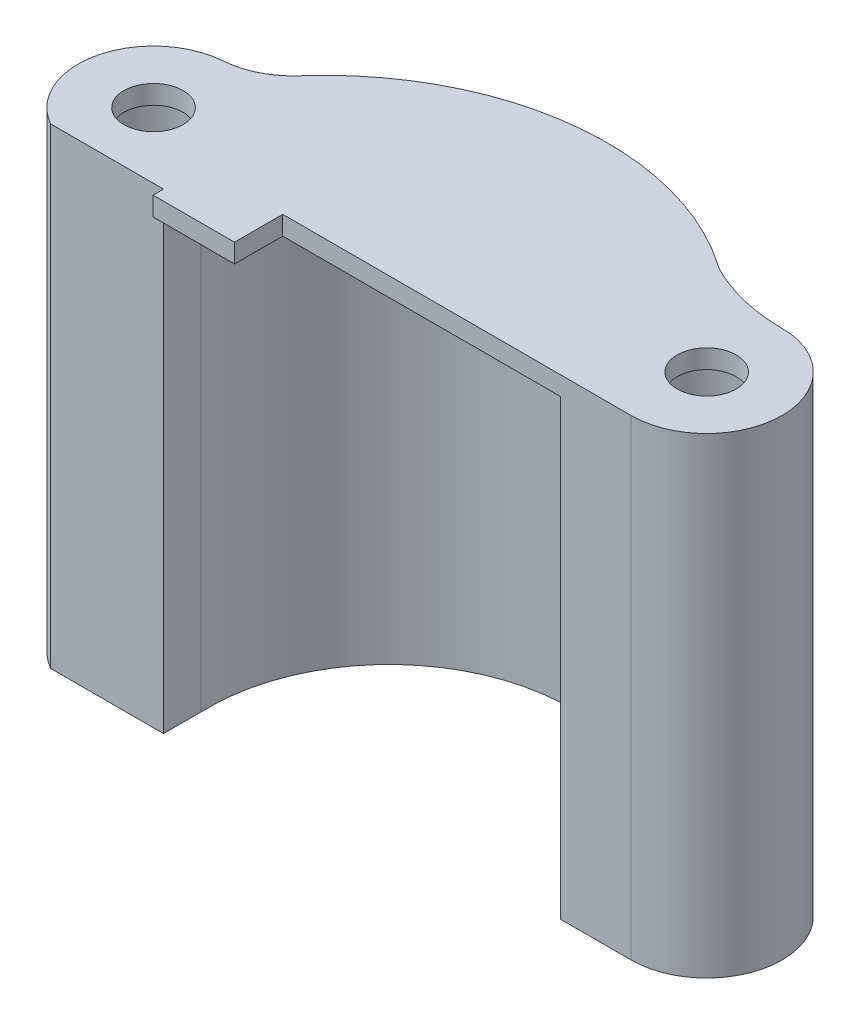
ISO-10303-21;
HEADER;
FILE_DESCRIPTION(('STEP AP214'),'2;1');
FILE_NAME('part.step','',(''),(''),'','','');
FILE_SCHEMA(('AUTOMOTIVE_DESIGN { 1 0 10303 214 1 1 1 1 }'));
ENDSEC;
DATA;
#1=APPLICATION_CONTEXT('core data for automotive mechanical design processes');
#2=APPLICATION_PROTOCOL_DEFINITION('international standard','automotive_design',2000,#1);
#3=PRODUCT_CONTEXT('',#1,'mechanical');
#4=PRODUCT('Part','Part','',(#3));
#5=PRODUCT_RELATED_PRODUCT_CATEGORY('part','',(#4));
#6=PRODUCT_DEFINITION_FORMATION('','',#4);
#7=PRODUCT_DEFINITION_CONTEXT('part definition',#1,'design');
#8=PRODUCT_DEFINITION('design','',#6,#7);
#9=PRODUCT_DEFINITION_SHAPE('','',#8);
#10=(LENGTH_UNIT() NAMED_UNIT(*) SI_UNIT(.MILLI.,.METRE.));
#11=(NAMED_UNIT(*) PLANE_ANGLE_UNIT() SI_UNIT($,.RADIAN.));
#12=(NAMED_UNIT(*) SI_UNIT($,.STERADIAN.) SOLID_ANGLE_UNIT());
#13=UNCERTAINTY_MEASURE_WITH_UNIT(LENGTH_MEASURE(1.E-05),#10,'distance_accuracy_value','');
#14=(GEOMETRIC_REPRESENTATION_CONTEXT(3) GLOBAL_UNCERTAINTY_ASSIGNED_CONTEXT((#13)) GLOBAL_UNIT_ASSIGNED_CONTEXT((#10,
#11,#12)) REPRESENTATION_CONTEXT('',''));
#15=CARTESIAN_POINT('',(0.,0.,0.));
#16=DIRECTION('',(0.,0.,1.));
#17=DIRECTION('',(1.,0.,0.));
#18=AXIS2_PLACEMENT_3D('',#15,#16,#17);
#19=CARTESIAN_POINT('',(-13.6378226737925,38.1,0.));
#20=DIRECTION('',(-1.,0.,0.));
#21=DIRECTION('',(0.,0.,1.));
#22=AXIS2_PLACEMENT_3D('',#19,#20,#21);
#23=PLANE('',#22);
#24=DIRECTION('',(0.,0.,1.));
#25=VECTOR('',#24,1.);
#26=CARTESIAN_POINT('',(-13.6378226737925,38.1,0.));
#27=LINE('',#26,#25);
#28=CARTESIAN_POINT('',(-13.6378226737925,38.1,15.7404965999173));
#29=VERTEX_POINT('',#28);
#30=CARTESIAN_POINT('',(-13.6378226737925,38.1,18.9154965999173));
#31=VERTEX_POINT('',#30);
#32=EDGE_CURVE('E321',#29,#31,#27,.T.);
#33=ORIENTED_EDGE('',*,*,#32,.T.);
#34=DIRECTION('',(0.,-1.,0.));
#35=VECTOR('',#34,1.);
#36=CARTESIAN_POINT('',(-13.6378226737925,38.1,18.9154965999173));
#37=LINE('',#36,#35);
#38=CARTESIAN_POINT('',(-13.6378226737925,0.,18.9154965999173));
#39=VERTEX_POINT('',#38);
#40=EDGE_CURVE('E268',#31,#39,#37,.T.);
#41=ORIENTED_EDGE('',*,*,#40,.T.);
#42=DIRECTION('',(0.,0.,-1.));
#43=VECTOR('',#42,1.);
#44=CARTESIAN_POINT('',(-13.6378226737925,0.,0.));
#45=LINE('',#44,#43);
#46=CARTESIAN_POINT('',(-13.6378226737925,0.,15.7404965999173));
#47=VERTEX_POINT('',#46);
#48=EDGE_CURVE('E225',#39,#47,#45,.T.);
#49=ORIENTED_EDGE('',*,*,#48,.T.);
#50=DIRECTION('',(0.,-1.,0.));
#51=VECTOR('',#50,1.);
#52=CARTESIAN_POINT('',(-13.6378226737925,38.1,15.7404965999173));
#53=LINE('',#52,#51);
#54=EDGE_CURVE('E264',#29,#47,#53,.T.);
#55=ORIENTED_EDGE('',*,*,#54,.F.);
#56=EDGE_LOOP('',(#33,#41,#49,#55));
#57=FACE_BOUND('',#56,.T.);
#58=ADVANCED_FACE('F41',(#57),#23,.F.);
#59=CARTESIAN_POINT('',(0.,38.1,15.7404965999173));
#60=DIRECTION('',(0.,0.,-1.));
#61=DIRECTION('',(-1.,0.,0.));
#62=AXIS2_PLACEMENT_3D('',#59,#60,#61);
#63=PLANE('',#62);
#64=DIRECTION('',(0.,1.,0.));
#65=VECTOR('',#64,1.);
#66=CARTESIAN_POINT('',(-6.77982267379246,17.7380475663924,15.7404965999173));
#67=LINE('',#66,#65);
#68=CARTESIAN_POINT('',(-6.77982267379246,38.1,15.7404965999173));
#69=VERTEX_POINT('',#68);
#70=CARTESIAN_POINT('',(-6.77982267379246,39.6875,15.7404965999173));
#71=VERTEX_POINT('',#70);
#72=EDGE_CURVE('E145',#69,#71,#67,.T.);
#73=ORIENTED_EDGE('',*,*,#72,.F.);
#74=DIRECTION('',(1.,0.,0.));
#75=VECTOR('',#74,1.);
#76=CARTESIAN_POINT('',(-13.6378226737925,38.1,15.7404965999173));
#77=LINE('',#76,#75);
#78=CARTESIAN_POINT('',(16.6090859378619,38.1,15.7404965999173));
#79=VERTEX_POINT('',#78);
#80=EDGE_CURVE('E175',#69,#79,#77,.T.);
#81=ORIENTED_EDGE('',*,*,#80,.T.);
#82=DIRECTION('',(0.,-1.,0.));
#83=VECTOR('',#82,1.);
#84=CARTESIAN_POINT('',(16.6090859378619,38.1,15.7404965999173));
#85=LINE('',#84,#83);
#86=CARTESIAN_POINT('',(16.6090859378619,0.,15.7404965999173));
#87=VERTEX_POINT('',#86);
#88=EDGE_CURVE('E257',#79,#87,#85,.T.);
#89=ORIENTED_EDGE('',*,*,#88,.T.);
#90=DIRECTION('',(1.,0.,0.));
#91=VECTOR('',#90,1.);
#92=CARTESIAN_POINT('',(0.,0.,15.7404965999173));
#93=LINE('',#92,#91);
#94=CARTESIAN_POINT('',(22.5456913931761,0.,15.7404965999173));
#95=VERTEX_POINT('',#94);
#96=EDGE_CURVE('E235',#87,#95,#93,.T.);
#97=ORIENTED_EDGE('',*,*,#96,.T.);
#98=DIRECTION('',(0.,-1.,0.));
#99=VECTOR('',#98,1.);
#100=CARTESIAN_POINT('',(22.5456913931761,38.1,15.7404965999173));
#101=LINE('',#100,#99);
#102=CARTESIAN_POINT('',(22.5456913931761,39.6875,15.7404965999173));
#103=VERTEX_POINT('',#102);
#104=EDGE_CURVE('E171',#103,#95,#101,.T.);
#105=ORIENTED_EDGE('',*,*,#104,.F.);
#106=DIRECTION('',(1.,0.,0.));
#107=VECTOR('',#106,1.);
#108=CARTESIAN_POINT('',(16.6090859378619,39.6875,15.7404965999173));
#109=LINE('',#108,#107);
#110=EDGE_CURVE('E162',#71,#103,#109,.T.);
#111=ORIENTED_EDGE('',*,*,#110,.F.);
#112=EDGE_LOOP('',(#73,#81,#89,#97,#105,#111));
#113=FACE_BOUND('',#112,.T.);
#114=ADVANCED_FACE('F169',(#113),#63,.F.);
#115=CARTESIAN_POINT('',(16.6090859378619,38.1,0.));
#116=DIRECTION('',(1.,0.,0.));
#117=DIRECTION('',(0.,0.,-1.));
#118=AXIS2_PLACEMENT_3D('',#115,#116,#117);
#119=PLANE('',#118);
#120=DIRECTION('',(0.,0.,-1.));
#121=VECTOR('',#120,1.);
#122=CARTESIAN_POINT('',(16.6090859378619,38.1,0.));
#123=LINE('',#122,#121);
#124=CARTESIAN_POINT('',(16.6090859378619,38.1,12.5654965999173));
#125=VERTEX_POINT('',#124);
#126=EDGE_CURVE('E336',#79,#125,#123,.T.);
#127=ORIENTED_EDGE('',*,*,#126,.T.);
#128=DIRECTION('',(0.,-1.,0.));
#129=VECTOR('',#128,1.);
#130=CARTESIAN_POINT('',(16.6090859378619,38.1,12.5654965999173));
#131=LINE('',#130,#129);
#132=CARTESIAN_POINT('',(16.6090859378619,0.,12.5654965999173));
#133=VERTEX_POINT('',#132);
#134=EDGE_CURVE('E260',#125,#133,#131,.T.);
#135=ORIENTED_EDGE('',*,*,#134,.T.);
#136=DIRECTION('',(0.,0.,1.));
#137=VECTOR('',#136,1.);
#138=CARTESIAN_POINT('',(16.6090859378619,0.,0.));
#139=LINE('',#138,#137);
#140=EDGE_CURVE('E231',#133,#87,#139,.T.);
#141=ORIENTED_EDGE('',*,*,#140,.T.);
#142=ORIENTED_EDGE('',*,*,#88,.F.);
#143=EDGE_LOOP('',(#127,#135,#141,#142));
#144=FACE_BOUND('',#143,.T.);
#145=ADVANCED_FACE('F384',(#144),#119,.F.);
#146=CARTESIAN_POINT('',(1.66297527786936,38.1,20.6134230140809));
#147=DIRECTION('',(0.,-1.,0.));
#148=DIRECTION('',(0.,0.,-1.));
#149=AXIS2_PLACEMENT_3D('',#146,#147,#148);
#150=CYLINDRICAL_SURFACE('',#149,23.746023500555);
#151=CARTESIAN_POINT('',(1.66297527786936,39.6875,20.6134230140809));
#152=DIRECTION('',(0.,1.,0.));
#153=DIRECTION('',(0.,0.,1.));
#154=AXIS2_PLACEMENT_3D('',#151,#152,#153);
#155=CIRCLE('',#154,23.746023500555);
#156=CARTESIAN_POINT('',(15.1487765830653,39.6875,1.06842889165444));
#157=VERTEX_POINT('',#156);
#158=CARTESIAN_POINT('',(-16.1639042572107,39.6875,4.92661332789374));
#159=VERTEX_POINT('',#158);
#160=EDGE_CURVE('E190',#157,#159,#155,.T.);
#161=ORIENTED_EDGE('',*,*,#160,.F.);
#162=DIRECTION('',(0.,-1.,0.));
#163=VECTOR('',#162,1.);
#164=CARTESIAN_POINT('',(15.1487765830653,38.1,1.06842889165443));
#165=LINE('',#164,#163);
#166=CARTESIAN_POINT('',(15.1487765830653,0.,1.06842889165443));
#167=VERTEX_POINT('',#166);
#168=EDGE_CURVE('E279',#157,#167,#165,.T.);
#169=ORIENTED_EDGE('',*,*,#168,.T.);
#170=CARTESIAN_POINT('',(1.66297527786936,0.,20.6134230140809));
#171=DIRECTION('',(0.,1.,0.));
#172=DIRECTION('',(0.,0.,1.));
#173=AXIS2_PLACEMENT_3D('',#170,#171,#172);
#174=CIRCLE('',#173,23.746023500555);
#175=CARTESIAN_POINT('',(-16.1639042572107,0.,4.92661332789373));
#176=VERTEX_POINT('',#175);
#177=EDGE_CURVE('E211',#176,#167,#174,.F.);
#178=ORIENTED_EDGE('',*,*,#177,.F.);
#179=DIRECTION('',(0.,-1.,0.));
#180=VECTOR('',#179,1.);
#181=CARTESIAN_POINT('',(-16.1639042572107,38.1,4.92661332789373));
#182=LINE('',#181,#180);
#183=EDGE_CURVE('E276',#176,#159,#182,.F.);
#184=ORIENTED_EDGE('',*,*,#183,.T.);
#185=EDGE_LOOP('',(#161,#169,#178,#184));
#186=FACE_BOUND('',#185,.T.);
#187=ADVANCED_FACE('F303',(#186),#150,.T.);
#188=CARTESIAN_POINT('',(-19.9966884261341,38.1,13.3973356971205));
#189=DIRECTION('',(0.,-1.,0.));
#190=DIRECTION('',(0.,0.,-1.));
#191=AXIS2_PLACEMENT_3D('',#188,#189,#190);
#192=CYLINDRICAL_SURFACE('',#191,6.35);
#193=CARTESIAN_POINT('',(-19.9966884261341,39.6875,13.3973356971205));
#194=DIRECTION('',(0.,1.,0.));
#195=DIRECTION('',(0.,0.,1.));
#196=AXIS2_PLACEMENT_3D('',#193,#194,#195);
#197=CIRCLE('',#196,6.35);
#198=CARTESIAN_POINT('',(-20.4638677435349,39.6875,7.06454456797428));
#199=VERTEX_POINT('',#198);
#200=CARTESIAN_POINT('',(-23.1387260215241,39.6875,18.9154965999173));
#201=VERTEX_POINT('',#200);
#202=EDGE_CURVE('E193',#199,#201,#197,.T.);
#203=ORIENTED_EDGE('',*,*,#202,.F.);
#204=DIRECTION('',(0.,-1.,0.));
#205=VECTOR('',#204,1.);
#206=CARTESIAN_POINT('',(-20.4638677435349,38.1,7.06454456797428));
#207=LINE('',#206,#205);
#208=CARTESIAN_POINT('',(-20.4638677435349,0.,7.06454456797428));
#209=VERTEX_POINT('',#208);
#210=EDGE_CURVE('E286',#199,#209,#207,.T.);
#211=ORIENTED_EDGE('',*,*,#210,.T.);
#212=CARTESIAN_POINT('',(-19.9966884261341,0.,13.3973356971205));
#213=DIRECTION('',(0.,1.,0.));
#214=DIRECTION('',(0.,0.,1.));
#215=AXIS2_PLACEMENT_3D('',#212,#213,#214);
#216=CIRCLE('',#215,6.35);
#217=CARTESIAN_POINT('',(-23.1387260215241,0.,18.9154965999173));
#218=VERTEX_POINT('',#217);
#219=EDGE_CURVE('E218',#209,#218,#216,.T.);
#220=ORIENTED_EDGE('',*,*,#219,.T.);
#221=DIRECTION('',(0.,-1.,0.));
#222=VECTOR('',#221,1.);
#223=CARTESIAN_POINT('',(-23.1387260215241,38.1,18.9154965999173));
#224=LINE('',#223,#222);
#225=EDGE_CURVE('E272',#201,#218,#224,.T.);
#226=ORIENTED_EDGE('',*,*,#225,.F.);
#227=EDGE_LOOP('',(#203,#211,#220,#226));
#228=FACE_BOUND('',#227,.T.);
#229=ADVANCED_FACE('F306',(#228),#192,.T.);
#230=CARTESIAN_POINT('',(0.,38.1,18.9154965999173));
#231=DIRECTION('',(0.,0.,-1.));
#232=DIRECTION('',(-1.,0.,0.));
#233=AXIS2_PLACEMENT_3D('',#230,#231,#232);
#234=PLANE('',#233);
#235=DIRECTION('',(1.,0.,0.));
#236=VECTOR('',#235,1.);
#237=CARTESIAN_POINT('',(0.,0.,18.9154965999173));
#238=LINE('',#237,#236);
#239=EDGE_CURVE('E221',#218,#39,#238,.T.);
#240=ORIENTED_EDGE('',*,*,#239,.T.);
#241=ORIENTED_EDGE('',*,*,#40,.F.);
#242=CARTESIAN_POINT('',(-13.6378226737925,39.6875,18.9154965999173));
#243=VERTEX_POINT('',#242);
#244=EDGE_CURVE('E269',#243,#31,#37,.T.);
#245=ORIENTED_EDGE('',*,*,#244,.F.);
#246=DIRECTION('',(1.,0.,0.));
#247=VECTOR('',#246,1.);
#248=CARTESIAN_POINT('',(-23.1387260215241,39.6875,18.9154965999173));
#249=LINE('',#248,#247);
#250=EDGE_CURVE('E196',#201,#243,#249,.T.);
#251=ORIENTED_EDGE('',*,*,#250,.F.);
#252=ORIENTED_EDGE('',*,*,#225,.T.);
#253=EDGE_LOOP('',(#240,#241,#245,#251,#252));
#254=FACE_BOUND('',#253,.T.);
#255=ADVANCED_FACE('F311',(#254),#234,.F.);
#256=CARTESIAN_POINT('',(1.59099250923585,38.1,15.1567259932861));
#257=DIRECTION('',(0.,-1.,0.));
#258=DIRECTION('',(0.,0.,-1.));
#259=AXIS2_PLACEMENT_3D('',#256,#257,#258);
#260=CYLINDRICAL_SURFACE('',#259,15.24);
#261=CARTESIAN_POINT('',(1.59099250923585,0.,15.1567259932861));
#262=DIRECTION('',(0.,1.,0.));
#263=DIRECTION('',(0.,0.,1.));
#264=AXIS2_PLACEMENT_3D('',#261,#262,#263);
#265=CIRCLE('',#264,15.24);
#266=EDGE_CURVE('E228',#47,#133,#265,.F.);
#267=ORIENTED_EDGE('',*,*,#266,.T.);
#268=ORIENTED_EDGE('',*,*,#134,.F.);
#269=CARTESIAN_POINT('',(1.59099250923585,38.1,15.1567259932861));
#270=DIRECTION('',(0.,1.,0.));
#271=DIRECTION('',(0.,0.,1.));
#272=AXIS2_PLACEMENT_3D('',#269,#270,#271);
#273=CIRCLE('',#272,15.24);
#274=EDGE_CURVE('E201',#29,#125,#273,.F.);
#275=ORIENTED_EDGE('',*,*,#274,.F.);
#276=ORIENTED_EDGE('',*,*,#54,.T.);
#277=EDGE_LOOP('',(#267,#268,#275,#276));
#278=FACE_BOUND('',#277,.T.);
#279=ADVANCED_FACE('F388',(#278),#260,.F.);
#280=CARTESIAN_POINT('',(22.545691393176,38.1,9.39049659991733));
#281=DIRECTION('',(0.,-1.,0.));
#282=DIRECTION('',(0.,0.,-1.));
#283=AXIS2_PLACEMENT_3D('',#280,#281,#282);
#284=CYLINDRICAL_SURFACE('',#283,6.35);
#285=CARTESIAN_POINT('',(22.545691393176,0.,9.39049659991733));
#286=DIRECTION('',(0.,1.,0.));
#287=DIRECTION('',(0.,0.,1.));
#288=AXIS2_PLACEMENT_3D('',#285,#286,#287);
#289=CIRCLE('',#288,6.35);
#290=CARTESIAN_POINT('',(22.545691393176,0.,3.04049659991733));
#291=VERTEX_POINT('',#290);
#292=EDGE_CURVE('E238',#95,#291,#289,.T.);
#293=ORIENTED_EDGE('',*,*,#292,.T.);
#294=DIRECTION('',(0.,-1.,0.));
#295=VECTOR('',#294,1.);
#296=CARTESIAN_POINT('',(22.545691393176,38.1,3.04049659991733));
#297=LINE('',#296,#295);
#298=CARTESIAN_POINT('',(22.545691393176,39.6875,3.04049659991733));
#299=VERTEX_POINT('',#298);
#300=EDGE_CURVE('E205',#299,#291,#297,.T.);
#301=ORIENTED_EDGE('',*,*,#300,.F.);
#302=CARTESIAN_POINT('',(22.545691393176,39.6875,9.39049659991733));
#303=DIRECTION('',(0.,1.,0.));
#304=DIRECTION('',(0.,0.,1.));
#305=AXIS2_PLACEMENT_3D('',#302,#303,#304);
#306=CIRCLE('',#305,6.35);
#307=EDGE_CURVE('E174',#103,#299,#306,.T.);
#308=ORIENTED_EDGE('',*,*,#307,.F.);
#309=ORIENTED_EDGE('',*,*,#104,.T.);
#310=EDGE_LOOP('',(#293,#301,#308,#309));
#311=FACE_BOUND('',#310,.T.);
#312=ADVANCED_FACE('F414',(#311),#284,.T.);
#313=CARTESIAN_POINT('',(22.545691393176,38.1,9.39049659991733));
#314=DIRECTION('',(0.,-1.,0.));
#315=DIRECTION('',(0.,0.,-1.));
#316=AXIS2_PLACEMENT_3D('',#313,#314,#315);
#317=CYLINDRICAL_SURFACE('',#316,4.7625);
#318=CARTESIAN_POINT('',(22.545691393176,38.1,9.39049659991733));
#319=DIRECTION('',(0.,1.,0.));
#320=DIRECTION('',(0.,0.,1.));
#321=AXIS2_PLACEMENT_3D('',#318,#319,#320);
#322=CIRCLE('',#321,4.7625);
#323=CARTESIAN_POINT('',(22.545691393176,38.1,14.1529965999173));
#324=VERTEX_POINT('',#323);
#325=EDGE_CURVE('E207',#324,#324,#322,.T.);
#326=ORIENTED_EDGE('',*,*,#325,.T.);
#327=EDGE_LOOP('',(#326));
#328=FACE_BOUND('',#327,.T.);
#329=CARTESIAN_POINT('',(22.545691393176,0.,9.39049659991733));
#330=DIRECTION('',(0.,1.,0.));
#331=DIRECTION('',(0.,0.,1.));
#332=AXIS2_PLACEMENT_3D('',#329,#330,#331);
#333=CIRCLE('',#332,4.7625);
#334=CARTESIAN_POINT('',(22.545691393176,0.,14.1529965999173));
#335=VERTEX_POINT('',#334);
#336=EDGE_CURVE('E245',#335,#335,#333,.T.);
#337=ORIENTED_EDGE('',*,*,#336,.F.);
#338=EDGE_LOOP('',(#337));
#339=FACE_BOUND('',#338,.T.);
#340=ADVANCED_FACE('F416',(#328,#339),#317,.F.);
#341=CARTESIAN_POINT('',(22.545691393176,38.1,-12.1995034000827));
#342=DIRECTION('',(0.,-1.,0.));
#343=DIRECTION('',(0.,0.,-1.));
#344=AXIS2_PLACEMENT_3D('',#341,#342,#343);
#345=CYLINDRICAL_SURFACE('',#344,15.24);
#346=CARTESIAN_POINT('',(22.545691393176,0.,-12.1995034000827));
#347=DIRECTION('',(0.,1.,0.));
#348=DIRECTION('',(0.,0.,1.));
#349=AXIS2_PLACEMENT_3D('',#346,#347,#348);
#350=CIRCLE('',#349,15.24);
#351=CARTESIAN_POINT('',(16.0474623590527,0.,1.58565599036608));
#352=VERTEX_POINT('',#351);
#353=EDGE_CURVE('E241',#291,#352,#350,.F.);
#354=ORIENTED_EDGE('',*,*,#353,.T.);
#355=DIRECTION('',(0.,-1.,0.));
#356=VECTOR('',#355,1.);
#357=CARTESIAN_POINT('',(16.0474623590527,38.1,1.58565599036608));
#358=LINE('',#357,#356);
#359=CARTESIAN_POINT('',(16.0474623590527,39.6875,1.58565599036608));
#360=VERTEX_POINT('',#359);
#361=EDGE_CURVE('E283',#352,#360,#358,.F.);
#362=ORIENTED_EDGE('',*,*,#361,.T.);
#363=CARTESIAN_POINT('',(22.545691393176,39.6875,-12.1995034000827));
#364=DIRECTION('',(0.,-1.,0.));
#365=DIRECTION('',(0.,0.,1.));
#366=AXIS2_PLACEMENT_3D('',#363,#364,#365);
#367=CIRCLE('',#366,15.24);
#368=EDGE_CURVE('E179',#299,#360,#367,.T.);
#369=ORIENTED_EDGE('',*,*,#368,.F.);
#370=ORIENTED_EDGE('',*,*,#300,.T.);
#371=EDGE_LOOP('',(#354,#362,#369,#370));
#372=FACE_BOUND('',#371,.T.);
#373=ADVANCED_FACE('F408',(#372),#345,.F.);
#374=CARTESIAN_POINT('',(-19.9966884261341,38.1,13.3973356971205));
#375=DIRECTION('',(0.,-1.,0.));
#376=DIRECTION('',(0.,0.,-1.));
#377=AXIS2_PLACEMENT_3D('',#374,#375,#376);
#378=CYLINDRICAL_SURFACE('',#377,4.7625);
#379=CARTESIAN_POINT('',(-19.9966884261341,38.1,13.3973356971205));
#380=DIRECTION('',(0.,1.,0.));
#381=DIRECTION('',(0.,0.,1.));
#382=AXIS2_PLACEMENT_3D('',#379,#380,#381);
#383=CIRCLE('',#382,4.7625);
#384=CARTESIAN_POINT('',(-19.9966884261341,38.1,18.1598356971205));
#385=VERTEX_POINT('',#384);
#386=EDGE_CURVE('E199',#385,#385,#383,.T.);
#387=ORIENTED_EDGE('',*,*,#386,.T.);
#388=EDGE_LOOP('',(#387));
#389=FACE_BOUND('',#388,.T.);
#390=CARTESIAN_POINT('',(-19.9966884261341,0.,13.3973356971205));
#391=DIRECTION('',(0.,1.,0.));
#392=DIRECTION('',(0.,0.,1.));
#393=AXIS2_PLACEMENT_3D('',#390,#391,#392);
#394=CIRCLE('',#393,4.7625);
#395=CARTESIAN_POINT('',(-19.9966884261341,0.,18.1598356971205));
#396=VERTEX_POINT('',#395);
#397=EDGE_CURVE('E206',#396,#396,#394,.T.);
#398=ORIENTED_EDGE('',*,*,#397,.F.);
#399=EDGE_LOOP('',(#398));
#400=FACE_BOUND('',#399,.T.);
#401=ADVANCED_FACE('F538',(#389,#400),#378,.F.);
#402=CARTESIAN_POINT('',(0.,0.,0.));
#403=DIRECTION('',(0.,1.,0.));
#404=DIRECTION('',(0.,0.,1.));
#405=AXIS2_PLACEMENT_3D('',#402,#403,#404);
#406=PLANE('',#405);
#407=ORIENTED_EDGE('',*,*,#219,.F.);
#408=CARTESIAN_POINT('',(-20.9310470609358,0.,0.731753438828078));
#409=DIRECTION('',(0.,1.,0.));
#410=DIRECTION('',(0.,0.,1.));
#411=AXIS2_PLACEMENT_3D('',#408,#409,#410);
#412=CIRCLE('',#411,6.35);
#413=EDGE_CURVE('E50',#209,#176,#412,.T.);
#414=ORIENTED_EDGE('',*,*,#413,.T.);
#415=ORIENTED_EDGE('',*,*,#177,.T.);
#416=CARTESIAN_POINT('',(18.7550577899374,0.,-4.1581604223209));
#417=DIRECTION('',(0.,1.,0.));
#418=DIRECTION('',(0.,0.,1.));
#419=AXIS2_PLACEMENT_3D('',#416,#417,#418);
#420=CIRCLE('',#419,6.35);
#421=EDGE_CURVE('E289',#167,#352,#420,.T.);
#422=ORIENTED_EDGE('',*,*,#421,.T.);
#423=ORIENTED_EDGE('',*,*,#353,.F.);
#424=ORIENTED_EDGE('',*,*,#292,.F.);
#425=ORIENTED_EDGE('',*,*,#96,.F.);
#426=ORIENTED_EDGE('',*,*,#140,.F.);
#427=ORIENTED_EDGE('',*,*,#266,.F.);
#428=ORIENTED_EDGE('',*,*,#48,.F.);
#429=ORIENTED_EDGE('',*,*,#239,.F.);
#430=EDGE_LOOP('',(#407,#414,#415,#422,#423,#424,#425,#426,#427,#428,#429));
#431=FACE_BOUND('',#430,.T.);
#432=ORIENTED_EDGE('',*,*,#336,.T.);
#433=EDGE_LOOP('',(#432));
#434=FACE_BOUND('',#433,.T.);
#435=ORIENTED_EDGE('',*,*,#397,.T.);
#436=EDGE_LOOP('',(#435));
#437=FACE_BOUND('',#436,.T.);
#438=ADVANCED_FACE('F298',(#431,#434,#437),#406,.F.);
#439=CARTESIAN_POINT('',(22.545691393176,38.1,9.39049659991733));
#440=DIRECTION('',(0.,1.,0.));
#441=DIRECTION('',(0.,0.,1.));
#442=AXIS2_PLACEMENT_3D('',#439,#440,#441);
#443=PLANE('',#442);
#444=ORIENTED_EDGE('',*,*,#80,.F.);
#445=DIRECTION('',(0.,0.,-1.));
#446=VECTOR('',#445,1.);
#447=CARTESIAN_POINT('',(-6.77982267379246,38.1,0.));
#448=LINE('',#447,#446);
#449=CARTESIAN_POINT('',(-6.77982267379246,38.1,19.7970649049161));
#450=VERTEX_POINT('',#449);
#451=EDGE_CURVE('E151',#450,#69,#448,.T.);
#452=ORIENTED_EDGE('',*,*,#451,.F.);
#453=DIRECTION('',(-1.,0.,0.));
#454=VECTOR('',#453,1.);
#455=CARTESIAN_POINT('',(0.,38.1,19.7970649049161));
#456=LINE('',#455,#454);
#457=CARTESIAN_POINT('',(-13.6378226737925,38.1,19.7970649049161));
#458=VERTEX_POINT('',#457);
#459=EDGE_CURVE('E324',#450,#458,#456,.T.);
#460=ORIENTED_EDGE('',*,*,#459,.T.);
#461=EDGE_CURVE('E316',#31,#458,#27,.T.);
#462=ORIENTED_EDGE('',*,*,#461,.F.);
#463=ORIENTED_EDGE('',*,*,#32,.F.);
#464=ORIENTED_EDGE('',*,*,#274,.T.);
#465=ORIENTED_EDGE('',*,*,#126,.F.);
#466=EDGE_LOOP('',(#444,#452,#460,#462,#463,#464,#465));
#467=FACE_BOUND('',#466,.T.);
#468=ADVANCED_FACE('F320',(#467),#443,.F.);
#469=ORIENTED_EDGE('',*,*,#325,.F.);
#470=EDGE_LOOP('',(#469));
#471=FACE_BOUND('',#470,.T.);
#472=CARTESIAN_POINT('',(22.545691393176,38.1,9.39049659991733));
#473=DIRECTION('',(0.,1.,0.));
#474=DIRECTION('',(0.,0.,1.));
#475=AXIS2_PLACEMENT_3D('',#472,#473,#474);
#476=CIRCLE('',#475,2.4892);
#477=CARTESIAN_POINT('',(22.545691393176,38.1,11.8796965999173));
#478=VERTEX_POINT('',#477);
#479=EDGE_CURVE('E184',#478,#478,#476,.T.);
#480=ORIENTED_EDGE('',*,*,#479,.T.);
#481=EDGE_LOOP('',(#480));
#482=FACE_BOUND('',#481,.T.);
#483=ADVANCED_FACE('F363',(#471,#482),#443,.F.);
#484=CARTESIAN_POINT('',(22.545691393176,39.6875,9.39049659991733));
#485=DIRECTION('',(0.,1.,0.));
#486=DIRECTION('',(0.,0.,1.));
#487=AXIS2_PLACEMENT_3D('',#484,#485,#486);
#488=PLANE('',#487);
#489=DIRECTION('',(0.,0.,1.));
#490=VECTOR('',#489,1.);
#491=CARTESIAN_POINT('',(-6.77982267379246,39.6875,0.));
#492=LINE('',#491,#490);
#493=CARTESIAN_POINT('',(-6.77982267379246,39.6875,19.7970649049161));
#494=VERTEX_POINT('',#493);
#495=EDGE_CURVE('E149',#71,#494,#492,.T.);
#496=ORIENTED_EDGE('',*,*,#495,.F.);
#497=ORIENTED_EDGE('',*,*,#110,.T.);
#498=ORIENTED_EDGE('',*,*,#307,.T.);
#499=ORIENTED_EDGE('',*,*,#368,.T.);
#500=CARTESIAN_POINT('',(18.7550577899374,39.6875,-4.1581604223209));
#501=DIRECTION('',(0.,1.,0.));
#502=DIRECTION('',(0.,0.,1.));
#503=AXIS2_PLACEMENT_3D('',#500,#501,#502);
#504=CIRCLE('',#503,6.35);
#505=EDGE_CURVE('E292',#360,#157,#504,.F.);
#506=ORIENTED_EDGE('',*,*,#505,.T.);
#507=ORIENTED_EDGE('',*,*,#160,.T.);
#508=CARTESIAN_POINT('',(-20.9310470609358,39.6875,0.731753438828078));
#509=DIRECTION('',(0.,1.,0.));
#510=DIRECTION('',(0.,0.,1.));
#511=AXIS2_PLACEMENT_3D('',#508,#509,#510);
#512=CIRCLE('',#511,6.35);
#513=EDGE_CURVE('E11',#159,#199,#512,.F.);
#514=ORIENTED_EDGE('',*,*,#513,.T.);
#515=ORIENTED_EDGE('',*,*,#202,.T.);
#516=ORIENTED_EDGE('',*,*,#250,.T.);
#517=DIRECTION('',(0.,0.,-1.));
#518=VECTOR('',#517,1.);
#519=CARTESIAN_POINT('',(-13.6378226737925,39.6875,0.));
#520=LINE('',#519,#518);
#521=CARTESIAN_POINT('',(-13.6378226737925,39.6875,19.7970649049161));
#522=VERTEX_POINT('',#521);
#523=EDGE_CURVE('E167',#522,#243,#520,.T.);
#524=ORIENTED_EDGE('',*,*,#523,.F.);
#525=DIRECTION('',(1.,0.,0.));
#526=VECTOR('',#525,1.);
#527=CARTESIAN_POINT('',(0.,39.6875,19.7970649049161));
#528=LINE('',#527,#526);
#529=EDGE_CURVE('E157',#522,#494,#528,.T.);
#530=ORIENTED_EDGE('',*,*,#529,.T.);
#531=EDGE_LOOP('',(#496,#497,#498,#499,#506,#507,#514,#515,#516,#524,#530));
#532=FACE_BOUND('',#531,.T.);
#533=CARTESIAN_POINT('',(22.545691393176,39.6875,9.39049659991733));
#534=DIRECTION('',(0.,1.,0.));
#535=DIRECTION('',(0.,0.,1.));
#536=AXIS2_PLACEMENT_3D('',#533,#534,#535);
#537=CIRCLE('',#536,2.4892);
#538=CARTESIAN_POINT('',(22.545691393176,39.6875,11.8796965999173));
#539=VERTEX_POINT('',#538);
#540=EDGE_CURVE('E181',#539,#539,#537,.T.);
#541=ORIENTED_EDGE('',*,*,#540,.F.);
#542=EDGE_LOOP('',(#541));
#543=FACE_BOUND('',#542,.T.);
#544=CARTESIAN_POINT('',(-19.9966884261341,39.6875,13.3973356971205));
#545=DIRECTION('',(0.,1.,0.));
#546=DIRECTION('',(0.,0.,1.));
#547=AXIS2_PLACEMENT_3D('',#544,#545,#546);
#548=CIRCLE('',#547,2.4892);
#549=CARTESIAN_POINT('',(-19.9966884261341,39.6875,15.8865356971205));
#550=VERTEX_POINT('',#549);
#551=EDGE_CURVE('E349',#550,#550,#548,.T.);
#552=ORIENTED_EDGE('',*,*,#551,.F.);
#553=EDGE_LOOP('',(#552));
#554=FACE_BOUND('',#553,.T.);
#555=ADVANCED_FACE('F159',(#532,#543,#554),#488,.T.);
#556=ORIENTED_EDGE('',*,*,#386,.F.);
#557=EDGE_LOOP('',(#556));
#558=FACE_BOUND('',#557,.T.);
#559=CARTESIAN_POINT('',(-19.9966884261341,38.1,13.3973356971205));
#560=DIRECTION('',(0.,1.,0.));
#561=DIRECTION('',(0.,0.,1.));
#562=AXIS2_PLACEMENT_3D('',#559,#560,#561);
#563=CIRCLE('',#562,2.4892);
#564=CARTESIAN_POINT('',(-19.9966884261341,38.1,15.8865356971205));
#565=VERTEX_POINT('',#564);
#566=EDGE_CURVE('E348',#565,#565,#563,.T.);
#567=ORIENTED_EDGE('',*,*,#566,.T.);
#568=EDGE_LOOP('',(#567));
#569=FACE_BOUND('',#568,.T.);
#570=ADVANCED_FACE('F368',(#558,#569),#443,.F.);
#571=CARTESIAN_POINT('',(22.545691393176,39.6875,9.39049659991733));
#572=DIRECTION('',(0.,-1.,0.));
#573=DIRECTION('',(0.,0.,-1.));
#574=AXIS2_PLACEMENT_3D('',#571,#572,#573);
#575=CYLINDRICAL_SURFACE('',#574,2.4892);
#576=ORIENTED_EDGE('',*,*,#540,.T.);
#577=EDGE_LOOP('',(#576));
#578=FACE_BOUND('',#577,.T.);
#579=ORIENTED_EDGE('',*,*,#479,.F.);
#580=EDGE_LOOP('',(#579));
#581=FACE_BOUND('',#580,.T.);
#582=ADVANCED_FACE('F365',(#578,#581),#575,.F.);
#583=CARTESIAN_POINT('',(-19.9966884261341,39.6875,13.3973356971205));
#584=DIRECTION('',(0.,-1.,0.));
#585=DIRECTION('',(0.,0.,-1.));
#586=AXIS2_PLACEMENT_3D('',#583,#584,#585);
#587=CYLINDRICAL_SURFACE('',#586,2.4892);
#588=ORIENTED_EDGE('',*,*,#551,.T.);
#589=EDGE_LOOP('',(#588));
#590=FACE_BOUND('',#589,.T.);
#591=ORIENTED_EDGE('',*,*,#566,.F.);
#592=EDGE_LOOP('',(#591));
#593=FACE_BOUND('',#592,.T.);
#594=ADVANCED_FACE('F367',(#590,#593),#587,.F.);
#595=CARTESIAN_POINT('',(-13.6378226737925,17.7380475663924,0.));
#596=DIRECTION('',(1.,0.,0.));
#597=DIRECTION('',(0.,0.,-1.));
#598=AXIS2_PLACEMENT_3D('',#595,#596,#597);
#599=PLANE('',#598);
#600=ORIENTED_EDGE('',*,*,#523,.T.);
#601=ORIENTED_EDGE('',*,*,#244,.T.);
#602=ORIENTED_EDGE('',*,*,#461,.T.);
#603=DIRECTION('',(0.,1.,0.));
#604=VECTOR('',#603,1.);
#605=CARTESIAN_POINT('',(-13.6378226737925,17.7380475663924,19.7970649049161));
#606=LINE('',#605,#604);
#607=EDGE_CURVE('E156',#458,#522,#606,.T.);
#608=ORIENTED_EDGE('',*,*,#607,.T.);
#609=EDGE_LOOP('',(#600,#601,#602,#608));
#610=FACE_BOUND('',#609,.T.);
#611=ADVANCED_FACE('F315',(#610),#599,.F.);
#612=CARTESIAN_POINT('',(0.,17.7380475663924,19.7970649049161));
#613=DIRECTION('',(0.,0.,1.));
#614=DIRECTION('',(1.,0.,0.));
#615=AXIS2_PLACEMENT_3D('',#612,#613,#614);
#616=PLANE('',#615);
#617=ORIENTED_EDGE('',*,*,#459,.F.);
#618=DIRECTION('',(0.,1.,0.));
#619=VECTOR('',#618,1.);
#620=CARTESIAN_POINT('',(-6.77982267379246,17.7380475663924,19.7970649049161));
#621=LINE('',#620,#619);
#622=EDGE_CURVE('E327',#450,#494,#621,.T.);
#623=ORIENTED_EDGE('',*,*,#622,.T.);
#624=ORIENTED_EDGE('',*,*,#529,.F.);
#625=ORIENTED_EDGE('',*,*,#607,.F.);
#626=EDGE_LOOP('',(#617,#623,#624,#625));
#627=FACE_BOUND('',#626,.T.);
#628=ADVANCED_FACE('F402',(#627),#616,.T.);
#629=CARTESIAN_POINT('',(-6.77982267379246,17.7380475663924,0.));
#630=DIRECTION('',(-1.,0.,0.));
#631=DIRECTION('',(0.,0.,1.));
#632=AXIS2_PLACEMENT_3D('',#629,#630,#631);
#633=PLANE('',#632);
#634=ORIENTED_EDGE('',*,*,#622,.F.);
#635=ORIENTED_EDGE('',*,*,#451,.T.);
#636=ORIENTED_EDGE('',*,*,#72,.T.);
#637=ORIENTED_EDGE('',*,*,#495,.T.);
#638=EDGE_LOOP('',(#634,#635,#636,#637));
#639=FACE_BOUND('',#638,.T.);
#640=ADVANCED_FACE('F148',(#639),#633,.F.);
#641=CARTESIAN_POINT('',(18.7550577899374,38.1,-4.1581604223209));
#642=DIRECTION('',(0.,-1.,0.));
#643=DIRECTION('',(0.,0.,-1.));
#644=AXIS2_PLACEMENT_3D('',#641,#642,#643);
#645=CYLINDRICAL_SURFACE('',#644,6.35);
#646=ORIENTED_EDGE('',*,*,#505,.F.);
#647=ORIENTED_EDGE('',*,*,#361,.F.);
#648=ORIENTED_EDGE('',*,*,#421,.F.);
#649=ORIENTED_EDGE('',*,*,#168,.F.);
#650=EDGE_LOOP('',(#646,#647,#648,#649));
#651=FACE_BOUND('',#650,.T.);
#652=ADVANCED_FACE('F395',(#651),#645,.F.);
#653=CARTESIAN_POINT('',(-20.9310470609358,38.1,0.731753438828078));
#654=DIRECTION('',(0.,1.,0.));
#655=DIRECTION('',(0.,0.,1.));
#656=AXIS2_PLACEMENT_3D('',#653,#654,#655);
#657=CYLINDRICAL_SURFACE('',#656,6.35);
#658=ORIENTED_EDGE('',*,*,#513,.F.);
#659=ORIENTED_EDGE('',*,*,#183,.F.);
#660=ORIENTED_EDGE('',*,*,#413,.F.);
#661=ORIENTED_EDGE('',*,*,#210,.F.);
#662=EDGE_LOOP('',(#658,#659,#660,#661));
#663=FACE_BOUND('',#662,.T.);
#664=ADVANCED_FACE('F43',(#663),#657,.F.);
#665=CLOSED_SHELL('',(#58,#114,#145,#187,#229,#255,#279,#312,#340,#373,#401,#438,#468,#483,#555,
#570,#582,#594,#611,#628,#640,#652,#664));
#666=MANIFOLD_SOLID_BREP('B2',#665);
#667=ADVANCED_BREP_SHAPE_REPRESENTATION('',(#18,#666),#14);
#668=SHAPE_DEFINITION_REPRESENTATION(#9,#667);
ENDSEC;
END-ISO-10303-21;
